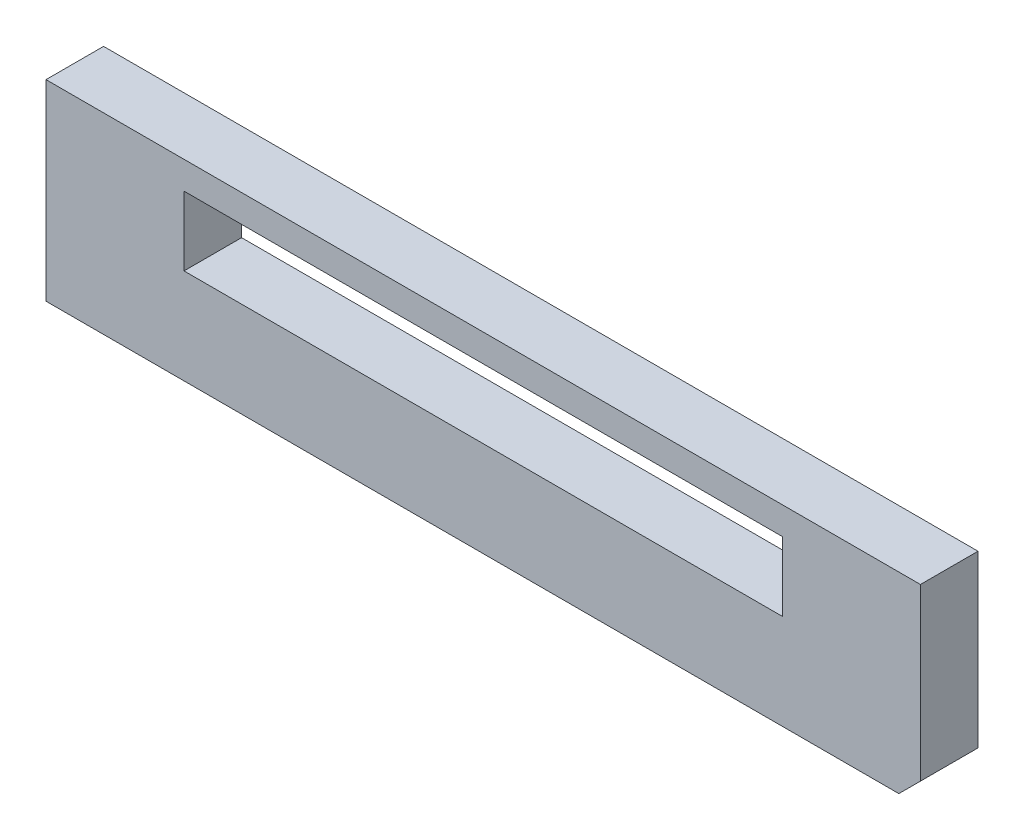
ISO-10303-21;
HEADER;
FILE_DESCRIPTION(('STEP AP214'),'2;1');
FILE_NAME('part.step','',(''),(''),'','','');
FILE_SCHEMA(('AUTOMOTIVE_DESIGN { 1 0 10303 214 1 1 1 1 }'));
ENDSEC;
DATA;
#1=APPLICATION_CONTEXT('core data for automotive mechanical design processes');
#2=APPLICATION_PROTOCOL_DEFINITION('international standard','automotive_design',2000,#1);
#3=PRODUCT_CONTEXT('',#1,'mechanical');
#4=PRODUCT('Part','Part','',(#3));
#5=PRODUCT_RELATED_PRODUCT_CATEGORY('part','',(#4));
#6=PRODUCT_DEFINITION_FORMATION('','',#4);
#7=PRODUCT_DEFINITION_CONTEXT('part definition',#1,'design');
#8=PRODUCT_DEFINITION('design','',#6,#7);
#9=PRODUCT_DEFINITION_SHAPE('','',#8);
#10=(LENGTH_UNIT() NAMED_UNIT(*) SI_UNIT(.MILLI.,.METRE.));
#11=(NAMED_UNIT(*) PLANE_ANGLE_UNIT() SI_UNIT($,.RADIAN.));
#12=(NAMED_UNIT(*) SI_UNIT($,.STERADIAN.) SOLID_ANGLE_UNIT());
#13=UNCERTAINTY_MEASURE_WITH_UNIT(LENGTH_MEASURE(1.E-05),#10,'distance_accuracy_value','');
#14=(GEOMETRIC_REPRESENTATION_CONTEXT(3) GLOBAL_UNCERTAINTY_ASSIGNED_CONTEXT((#13)) GLOBAL_UNIT_ASSIGNED_CONTEXT((#10,
#11,#12)) REPRESENTATION_CONTEXT('',''));
#15=CARTESIAN_POINT('',(0.,0.,0.));
#16=DIRECTION('',(0.,0.,1.));
#17=DIRECTION('',(1.,0.,0.));
#18=AXIS2_PLACEMENT_3D('',#15,#16,#17);
#19=CARTESIAN_POINT('',(0.,0.,5.34));
#20=DIRECTION('',(1.,0.,0.));
#21=DIRECTION('',(0.,0.,-1.));
#22=AXIS2_PLACEMENT_3D('',#19,#20,#21);
#23=PLANE('',#22);
#24=DIRECTION('',(0.,-1.,0.));
#25=VECTOR('',#24,1.);
#26=CARTESIAN_POINT('',(0.,0.,0.));
#27=LINE('',#26,#25);
#28=CARTESIAN_POINT('',(0.,17.8,0.));
#29=VERTEX_POINT('',#28);
#30=CARTESIAN_POINT('',(0.,0.,0.));
#31=VERTEX_POINT('',#30);
#32=EDGE_CURVE('E144',#29,#31,#27,.T.);
#33=ORIENTED_EDGE('',*,*,#32,.T.);
#34=DIRECTION('',(0.,0.,-1.));
#35=VECTOR('',#34,1.);
#36=CARTESIAN_POINT('',(0.,0.,5.34));
#37=LINE('',#36,#35);
#38=CARTESIAN_POINT('',(0.,0.,5.34));
#39=VERTEX_POINT('',#38);
#40=EDGE_CURVE('E173',#39,#31,#37,.T.);
#41=ORIENTED_EDGE('',*,*,#40,.F.);
#42=DIRECTION('',(0.,-1.,0.));
#43=VECTOR('',#42,1.);
#44=CARTESIAN_POINT('',(0.,0.,5.34));
#45=LINE('',#44,#43);
#46=CARTESIAN_POINT('',(0.,17.8,5.34));
#47=VERTEX_POINT('',#46);
#48=EDGE_CURVE('E148',#47,#39,#45,.T.);
#49=ORIENTED_EDGE('',*,*,#48,.F.);
#50=DIRECTION('',(0.,0.,-1.));
#51=VECTOR('',#50,1.);
#52=CARTESIAN_POINT('',(0.,17.8,5.34));
#53=LINE('',#52,#51);
#54=EDGE_CURVE('E159',#47,#29,#53,.T.);
#55=ORIENTED_EDGE('',*,*,#54,.T.);
#56=EDGE_LOOP('',(#33,#41,#49,#55));
#57=FACE_BOUND('',#56,.T.);
#58=ADVANCED_FACE('F40',(#57),#23,.F.);
#59=CARTESIAN_POINT('',(0.,0.,5.34));
#60=DIRECTION('',(0.,1.,0.));
#61=DIRECTION('',(0.,0.,1.));
#62=AXIS2_PLACEMENT_3D('',#59,#60,#61);
#63=PLANE('',#62);
#64=DIRECTION('',(1.,0.,0.));
#65=VECTOR('',#64,1.);
#66=CARTESIAN_POINT('',(0.,0.,0.));
#67=LINE('',#66,#65);
#68=CARTESIAN_POINT('',(79.1,0.,0.));
#69=VERTEX_POINT('',#68);
#70=EDGE_CURVE('E162',#31,#69,#67,.T.);
#71=ORIENTED_EDGE('',*,*,#70,.T.);
#72=DIRECTION('',(0.,0.,1.));
#73=VECTOR('',#72,1.);
#74=CARTESIAN_POINT('',(79.1,0.,5.34));
#75=LINE('',#74,#73);
#76=CARTESIAN_POINT('',(79.1,0.,5.34));
#77=VERTEX_POINT('',#76);
#78=EDGE_CURVE('E49',#69,#77,#75,.T.);
#79=ORIENTED_EDGE('',*,*,#78,.T.);
#80=DIRECTION('',(1.,0.,0.));
#81=VECTOR('',#80,1.);
#82=CARTESIAN_POINT('',(0.,0.,5.34));
#83=LINE('',#82,#81);
#84=EDGE_CURVE('E151',#39,#77,#83,.T.);
#85=ORIENTED_EDGE('',*,*,#84,.F.);
#86=ORIENTED_EDGE('',*,*,#40,.T.);
#87=EDGE_LOOP('',(#71,#79,#85,#86));
#88=FACE_BOUND('',#87,.T.);
#89=ADVANCED_FACE('F182',(#88),#63,.F.);
#90=CARTESIAN_POINT('',(81.1,0.,5.34));
#91=DIRECTION('',(-1.,0.,0.));
#92=DIRECTION('',(0.,0.,1.));
#93=AXIS2_PLACEMENT_3D('',#90,#91,#92);
#94=PLANE('',#93);
#95=DIRECTION('',(0.,1.,0.));
#96=VECTOR('',#95,1.);
#97=CARTESIAN_POINT('',(81.1,0.,5.34));
#98=LINE('',#97,#96);
#99=CARTESIAN_POINT('',(81.1,2.,5.34));
#100=VERTEX_POINT('',#99);
#101=CARTESIAN_POINT('',(81.1,17.8,5.34));
#102=VERTEX_POINT('',#101);
#103=EDGE_CURVE('E155',#100,#102,#98,.T.);
#104=ORIENTED_EDGE('',*,*,#103,.F.);
#105=DIRECTION('',(0.,0.,-1.));
#106=VECTOR('',#105,1.);
#107=CARTESIAN_POINT('',(81.1,2.,5.34));
#108=LINE('',#107,#106);
#109=CARTESIAN_POINT('',(81.1,2.,0.));
#110=VERTEX_POINT('',#109);
#111=EDGE_CURVE('E176',#100,#110,#108,.T.);
#112=ORIENTED_EDGE('',*,*,#111,.T.);
#113=DIRECTION('',(0.,1.,0.));
#114=VECTOR('',#113,1.);
#115=CARTESIAN_POINT('',(81.1,0.,0.));
#116=LINE('',#115,#114);
#117=CARTESIAN_POINT('',(81.1,17.8,0.));
#118=VERTEX_POINT('',#117);
#119=EDGE_CURVE('E165',#110,#118,#116,.T.);
#120=ORIENTED_EDGE('',*,*,#119,.T.);
#121=DIRECTION('',(0.,0.,-1.));
#122=VECTOR('',#121,1.);
#123=CARTESIAN_POINT('',(81.1,17.8,5.34));
#124=LINE('',#123,#122);
#125=EDGE_CURVE('E170',#102,#118,#124,.T.);
#126=ORIENTED_EDGE('',*,*,#125,.F.);
#127=EDGE_LOOP('',(#104,#112,#120,#126));
#128=FACE_BOUND('',#127,.T.);
#129=ADVANCED_FACE('F193',(#128),#94,.F.);
#130=CARTESIAN_POINT('',(0.,17.8,5.34));
#131=DIRECTION('',(0.,-1.,0.));
#132=DIRECTION('',(0.,0.,-1.));
#133=AXIS2_PLACEMENT_3D('',#130,#131,#132);
#134=PLANE('',#133);
#135=DIRECTION('',(-1.,0.,0.));
#136=VECTOR('',#135,1.);
#137=CARTESIAN_POINT('',(0.,17.8,0.));
#138=LINE('',#137,#136);
#139=EDGE_CURVE('E152',#118,#29,#138,.T.);
#140=ORIENTED_EDGE('',*,*,#139,.T.);
#141=ORIENTED_EDGE('',*,*,#54,.F.);
#142=DIRECTION('',(-1.,0.,0.));
#143=VECTOR('',#142,1.);
#144=CARTESIAN_POINT('',(0.,17.8,5.34));
#145=LINE('',#144,#143);
#146=EDGE_CURVE('E157',#102,#47,#145,.T.);
#147=ORIENTED_EDGE('',*,*,#146,.F.);
#148=ORIENTED_EDGE('',*,*,#125,.T.);
#149=EDGE_LOOP('',(#140,#141,#147,#148));
#150=FACE_BOUND('',#149,.T.);
#151=ADVANCED_FACE('F199',(#150),#134,.F.);
#152=CARTESIAN_POINT('',(0.,0.,5.34));
#153=DIRECTION('',(0.,0.,-1.));
#154=DIRECTION('',(-1.,0.,0.));
#155=AXIS2_PLACEMENT_3D('',#152,#153,#154);
#156=PLANE('',#155);
#157=DIRECTION('',(1.,0.,0.));
#158=VECTOR('',#157,1.);
#159=CARTESIAN_POINT('',(12.8,8.83392320543626,5.34));
#160=LINE('',#159,#158);
#161=CARTESIAN_POINT('',(12.8,8.83392320543626,5.34));
#162=VERTEX_POINT('',#161);
#163=CARTESIAN_POINT('',(68.3,8.83392320543626,5.34));
#164=VERTEX_POINT('',#163);
#165=EDGE_CURVE('E138',#162,#164,#160,.T.);
#166=ORIENTED_EDGE('',*,*,#165,.F.);
#167=DIRECTION('',(0.,-1.,0.));
#168=VECTOR('',#167,1.);
#169=CARTESIAN_POINT('',(12.8,8.83392320543626,5.34));
#170=LINE('',#169,#168);
#171=CARTESIAN_POINT('',(12.8,15.24337227812,5.34));
#172=VERTEX_POINT('',#171);
#173=EDGE_CURVE('E56',#172,#162,#170,.T.);
#174=ORIENTED_EDGE('',*,*,#173,.F.);
#175=DIRECTION('',(-1.,0.,0.));
#176=VECTOR('',#175,1.);
#177=CARTESIAN_POINT('',(12.8,15.24337227812,5.34));
#178=LINE('',#177,#176);
#179=CARTESIAN_POINT('',(68.3,15.24337227812,5.34));
#180=VERTEX_POINT('',#179);
#181=EDGE_CURVE('E129',#180,#172,#178,.T.);
#182=ORIENTED_EDGE('',*,*,#181,.F.);
#183=DIRECTION('',(0.,1.,0.));
#184=VECTOR('',#183,1.);
#185=CARTESIAN_POINT('',(68.3,8.83392320543626,5.34));
#186=LINE('',#185,#184);
#187=EDGE_CURVE('E132',#164,#180,#186,.T.);
#188=ORIENTED_EDGE('',*,*,#187,.F.);
#189=EDGE_LOOP('',(#166,#174,#182,#188));
#190=FACE_BOUND('',#189,.T.);
#191=ORIENTED_EDGE('',*,*,#84,.T.);
#192=DIRECTION('',(-0.707106781186553,-0.707106781186542,0.));
#193=VECTOR('',#192,1.);
#194=CARTESIAN_POINT('',(81.1,2.,5.34));
#195=LINE('',#194,#193);
#196=EDGE_CURVE('E11',#77,#100,#195,.F.);
#197=ORIENTED_EDGE('',*,*,#196,.T.);
#198=ORIENTED_EDGE('',*,*,#103,.T.);
#199=ORIENTED_EDGE('',*,*,#146,.T.);
#200=ORIENTED_EDGE('',*,*,#48,.T.);
#201=EDGE_LOOP('',(#191,#197,#198,#199,#200));
#202=FACE_BOUND('',#201,.T.);
#203=ADVANCED_FACE('F186',(#190,#202),#156,.F.);
#204=CARTESIAN_POINT('',(0.,0.,0.));
#205=DIRECTION('',(0.,0.,-1.));
#206=DIRECTION('',(-1.,0.,0.));
#207=AXIS2_PLACEMENT_3D('',#204,#205,#206);
#208=PLANE('',#207);
#209=DIRECTION('',(0.,-1.,0.));
#210=VECTOR('',#209,1.);
#211=CARTESIAN_POINT('',(12.8,8.83392320543626,0.));
#212=LINE('',#211,#210);
#213=CARTESIAN_POINT('',(12.8,15.24337227812,0.));
#214=VERTEX_POINT('',#213);
#215=CARTESIAN_POINT('',(12.8,8.83392320543626,0.));
#216=VERTEX_POINT('',#215);
#217=EDGE_CURVE('E113',#214,#216,#212,.T.);
#218=ORIENTED_EDGE('',*,*,#217,.T.);
#219=DIRECTION('',(1.,0.,0.));
#220=VECTOR('',#219,1.);
#221=CARTESIAN_POINT('',(12.8,8.83392320543626,0.));
#222=LINE('',#221,#220);
#223=CARTESIAN_POINT('',(68.3,8.83392320543626,0.));
#224=VERTEX_POINT('',#223);
#225=EDGE_CURVE('E122',#216,#224,#222,.T.);
#226=ORIENTED_EDGE('',*,*,#225,.T.);
#227=DIRECTION('',(0.,1.,0.));
#228=VECTOR('',#227,1.);
#229=CARTESIAN_POINT('',(68.3,8.83392320543626,0.));
#230=LINE('',#229,#228);
#231=CARTESIAN_POINT('',(68.3,15.24337227812,0.));
#232=VERTEX_POINT('',#231);
#233=EDGE_CURVE('E64',#224,#232,#230,.T.);
#234=ORIENTED_EDGE('',*,*,#233,.T.);
#235=DIRECTION('',(-1.,0.,0.));
#236=VECTOR('',#235,1.);
#237=CARTESIAN_POINT('',(12.8,15.24337227812,0.));
#238=LINE('',#237,#236);
#239=EDGE_CURVE('E119',#232,#214,#238,.T.);
#240=ORIENTED_EDGE('',*,*,#239,.T.);
#241=EDGE_LOOP('',(#218,#226,#234,#240));
#242=FACE_BOUND('',#241,.T.);
#243=ORIENTED_EDGE('',*,*,#119,.F.);
#244=DIRECTION('',(0.707106781186553,0.707106781186542,0.));
#245=VECTOR('',#244,1.);
#246=CARTESIAN_POINT('',(39.5499999999994,-39.55,0.));
#247=LINE('',#246,#245);
#248=EDGE_CURVE('E179',#110,#69,#247,.F.);
#249=ORIENTED_EDGE('',*,*,#248,.T.);
#250=ORIENTED_EDGE('',*,*,#70,.F.);
#251=ORIENTED_EDGE('',*,*,#32,.F.);
#252=ORIENTED_EDGE('',*,*,#139,.F.);
#253=EDGE_LOOP('',(#243,#249,#250,#251,#252));
#254=FACE_BOUND('',#253,.T.);
#255=ADVANCED_FACE('F126',(#242,#254),#208,.T.);
#256=CARTESIAN_POINT('',(81.1,2.,5.34));
#257=DIRECTION('',(-0.707106781186542,0.707106781186553,0.));
#258=DIRECTION('',(0.,0.,-1.));
#259=AXIS2_PLACEMENT_3D('',#256,#257,#258);
#260=PLANE('',#259);
#261=ORIENTED_EDGE('',*,*,#196,.F.);
#262=ORIENTED_EDGE('',*,*,#78,.F.);
#263=ORIENTED_EDGE('',*,*,#248,.F.);
#264=ORIENTED_EDGE('',*,*,#111,.F.);
#265=EDGE_LOOP('',(#261,#262,#263,#264));
#266=FACE_BOUND('',#265,.T.);
#267=ADVANCED_FACE('F43',(#266),#260,.F.);
#268=CARTESIAN_POINT('',(12.8,8.83392320543626,0.));
#269=DIRECTION('',(-1.,0.,0.));
#270=DIRECTION('',(0.,0.,1.));
#271=AXIS2_PLACEMENT_3D('',#268,#269,#270);
#272=PLANE('',#271);
#273=ORIENTED_EDGE('',*,*,#173,.T.);
#274=DIRECTION('',(0.,0.,1.));
#275=VECTOR('',#274,1.);
#276=CARTESIAN_POINT('',(12.8,8.83392320543626,0.));
#277=LINE('',#276,#275);
#278=EDGE_CURVE('E109',#216,#162,#277,.T.);
#279=ORIENTED_EDGE('',*,*,#278,.F.);
#280=ORIENTED_EDGE('',*,*,#217,.F.);
#281=DIRECTION('',(0.,0.,1.));
#282=VECTOR('',#281,1.);
#283=CARTESIAN_POINT('',(12.8,15.24337227812,0.));
#284=LINE('',#283,#282);
#285=EDGE_CURVE('E142',#214,#172,#284,.T.);
#286=ORIENTED_EDGE('',*,*,#285,.T.);
#287=EDGE_LOOP('',(#273,#279,#280,#286));
#288=FACE_BOUND('',#287,.T.);
#289=ADVANCED_FACE('F111',(#288),#272,.F.);
#290=CARTESIAN_POINT('',(12.8,15.24337227812,0.));
#291=DIRECTION('',(0.,1.,0.));
#292=DIRECTION('',(0.,0.,1.));
#293=AXIS2_PLACEMENT_3D('',#290,#291,#292);
#294=PLANE('',#293);
#295=ORIENTED_EDGE('',*,*,#181,.T.);
#296=ORIENTED_EDGE('',*,*,#285,.F.);
#297=ORIENTED_EDGE('',*,*,#239,.F.);
#298=DIRECTION('',(0.,0.,1.));
#299=VECTOR('',#298,1.);
#300=CARTESIAN_POINT('',(68.3,15.24337227812,0.));
#301=LINE('',#300,#299);
#302=EDGE_CURVE('E145',#232,#180,#301,.T.);
#303=ORIENTED_EDGE('',*,*,#302,.T.);
#304=EDGE_LOOP('',(#295,#296,#297,#303));
#305=FACE_BOUND('',#304,.T.);
#306=ADVANCED_FACE('F219',(#305),#294,.F.);
#307=CARTESIAN_POINT('',(68.3,8.83392320543626,0.));
#308=DIRECTION('',(1.,0.,0.));
#309=DIRECTION('',(0.,0.,-1.));
#310=AXIS2_PLACEMENT_3D('',#307,#308,#309);
#311=PLANE('',#310);
#312=ORIENTED_EDGE('',*,*,#187,.T.);
#313=ORIENTED_EDGE('',*,*,#302,.F.);
#314=ORIENTED_EDGE('',*,*,#233,.F.);
#315=DIRECTION('',(0.,0.,1.));
#316=VECTOR('',#315,1.);
#317=CARTESIAN_POINT('',(68.3,8.83392320543626,0.));
#318=LINE('',#317,#316);
#319=EDGE_CURVE('E118',#224,#164,#318,.T.);
#320=ORIENTED_EDGE('',*,*,#319,.T.);
#321=EDGE_LOOP('',(#312,#313,#314,#320));
#322=FACE_BOUND('',#321,.T.);
#323=ADVANCED_FACE('F222',(#322),#311,.F.);
#324=CARTESIAN_POINT('',(12.8,8.83392320543626,0.));
#325=DIRECTION('',(0.,-1.,0.));
#326=DIRECTION('',(0.,0.,-1.));
#327=AXIS2_PLACEMENT_3D('',#324,#325,#326);
#328=PLANE('',#327);
#329=ORIENTED_EDGE('',*,*,#165,.T.);
#330=ORIENTED_EDGE('',*,*,#319,.F.);
#331=ORIENTED_EDGE('',*,*,#225,.F.);
#332=ORIENTED_EDGE('',*,*,#278,.T.);
#333=EDGE_LOOP('',(#329,#330,#331,#332));
#334=FACE_BOUND('',#333,.T.);
#335=ADVANCED_FACE('F123',(#334),#328,.F.);
#336=CLOSED_SHELL('',(#58,#89,#129,#151,#203,#255,#267,#289,#306,#323,#335));
#337=MANIFOLD_SOLID_BREP('B2',#336);
#338=ADVANCED_BREP_SHAPE_REPRESENTATION('',(#18,#337),#14);
#339=SHAPE_DEFINITION_REPRESENTATION(#9,#338);
ENDSEC;
END-ISO-10303-21;
